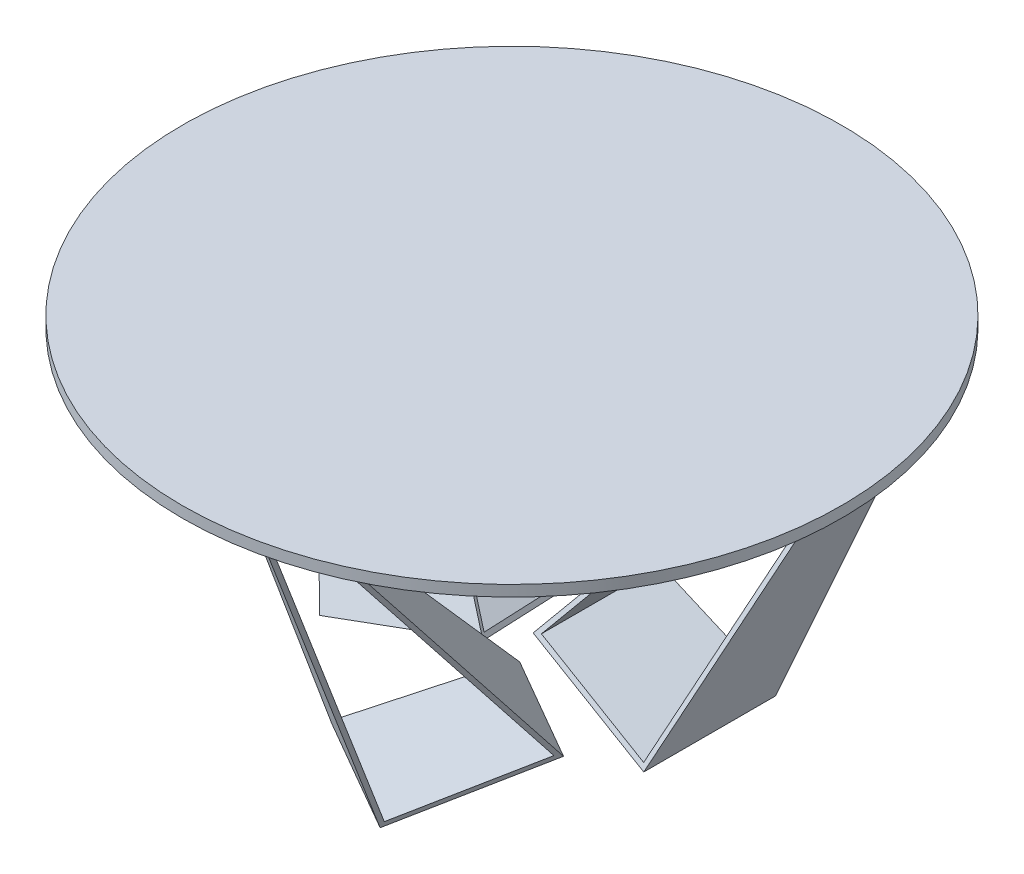
ISO-10303-21;
HEADER;
FILE_DESCRIPTION(('STEP AP214'),'2;1');
FILE_NAME('part.step','',(''),(''),'','','');
FILE_SCHEMA(('AUTOMOTIVE_DESIGN { 1 0 10303 214 1 1 1 1 }'));
ENDSEC;
DATA;
#1=APPLICATION_CONTEXT('core data for automotive mechanical design processes');
#2=APPLICATION_PROTOCOL_DEFINITION('international standard','automotive_design',2000,#1);
#3=PRODUCT_CONTEXT('',#1,'mechanical');
#4=PRODUCT('Part','Part','',(#3));
#5=PRODUCT_RELATED_PRODUCT_CATEGORY('part','',(#4));
#6=PRODUCT_DEFINITION_FORMATION('','',#4);
#7=PRODUCT_DEFINITION_CONTEXT('part definition',#1,'design');
#8=PRODUCT_DEFINITION('design','',#6,#7);
#9=PRODUCT_DEFINITION_SHAPE('','',#8);
#10=(LENGTH_UNIT() NAMED_UNIT(*) SI_UNIT(.MILLI.,.METRE.));
#11=(NAMED_UNIT(*) PLANE_ANGLE_UNIT() SI_UNIT($,.RADIAN.));
#12=(NAMED_UNIT(*) SI_UNIT($,.STERADIAN.) SOLID_ANGLE_UNIT());
#13=UNCERTAINTY_MEASURE_WITH_UNIT(LENGTH_MEASURE(1.E-05),#10,'distance_accuracy_value','');
#14=(GEOMETRIC_REPRESENTATION_CONTEXT(3) GLOBAL_UNCERTAINTY_ASSIGNED_CONTEXT((#13)) GLOBAL_UNIT_ASSIGNED_CONTEXT((#10,
#11,#12)) REPRESENTATION_CONTEXT('',''));
#15=CARTESIAN_POINT('',(0.,0.,0.));
#16=DIRECTION('',(0.,0.,1.));
#17=DIRECTION('',(1.,0.,0.));
#18=AXIS2_PLACEMENT_3D('',#15,#16,#17);
#19=CARTESIAN_POINT('',(0.,750.,0.));
#20=DIRECTION('',(0.,-1.,0.));
#21=DIRECTION('',(0.,0.,-1.));
#22=AXIS2_PLACEMENT_3D('',#19,#20,#21);
#23=CYLINDRICAL_SURFACE('',#22,750.);
#24=CARTESIAN_POINT('',(0.,750.,0.));
#25=DIRECTION('',(0.,1.,0.));
#26=DIRECTION('',(0.,0.,1.));
#27=AXIS2_PLACEMENT_3D('',#24,#25,#26);
#28=CIRCLE('',#27,750.);
#29=CARTESIAN_POINT('',(0.,750.,750.));
#30=VERTEX_POINT('',#29);
#31=EDGE_CURVE('E12',#30,#30,#28,.T.);
#32=ORIENTED_EDGE('',*,*,#31,.F.);
#33=EDGE_LOOP('',(#32));
#34=FACE_BOUND('',#33,.T.);
#35=CARTESIAN_POINT('',(0.,725.,0.));
#36=DIRECTION('',(0.,1.,0.));
#37=DIRECTION('',(0.,0.,1.));
#38=AXIS2_PLACEMENT_3D('',#35,#36,#37);
#39=CIRCLE('',#38,750.);
#40=CARTESIAN_POINT('',(0.,725.,750.));
#41=VERTEX_POINT('',#40);
#42=EDGE_CURVE('E49',#41,#41,#39,.T.);
#43=ORIENTED_EDGE('',*,*,#42,.T.);
#44=EDGE_LOOP('',(#43));
#45=FACE_BOUND('',#44,.T.);
#46=ADVANCED_FACE('F46',(#34,#45),#23,.T.);
#47=CARTESIAN_POINT('',(0.,750.,0.));
#48=DIRECTION('',(0.,1.,0.));
#49=DIRECTION('',(0.,0.,1.));
#50=AXIS2_PLACEMENT_3D('',#47,#48,#49);
#51=PLANE('',#50);
#52=ORIENTED_EDGE('',*,*,#31,.T.);
#53=EDGE_LOOP('',(#52));
#54=FACE_BOUND('',#53,.T.);
#55=ADVANCED_FACE('F61',(#54),#51,.T.);
#56=CARTESIAN_POINT('',(0.,725.,0.));
#57=DIRECTION('',(0.,1.,0.));
#58=DIRECTION('',(0.,0.,1.));
#59=AXIS2_PLACEMENT_3D('',#56,#57,#58);
#60=PLANE('',#59);
#61=ORIENTED_EDGE('',*,*,#42,.F.);
#62=EDGE_LOOP('',(#61));
#63=FACE_BOUND('',#62,.T.);
#64=ADVANCED_FACE('F59',(#63),#60,.F.);
#65=CLOSED_SHELL('',(#46,#55,#64));
#66=MANIFOLD_SOLID_BREP('B2',#65);
#67=CARTESIAN_POINT('',(-324.999999999995,0.,-562.916512459888));
#68=DIRECTION('',(-0.779900594511375,-0.434749065831176,0.450275818182282));
#69=DIRECTION('',(-0.376503735281354,0.900551636364579,0.217374532915584));
#70=AXIS2_PLACEMENT_3D('',#67,#68,#69);
#71=PLANE('',#70);
#72=DIRECTION('',(0.591437353248365,-0.747316742815364,0.302852345360579));
#73=VECTOR('',#72,1.);
#74=CARTESIAN_POINT('',(-568.448472121978,765.441822744605,-245.534358067453));
#75=LINE('',#74,#73);
#76=CARTESIAN_POINT('',(-536.442224657884,725.,-229.145188432743));
#77=VERTEX_POINT('',#76);
#78=CARTESIAN_POINT('',(-41.808122941318,100.,24.1379310344824));
#79=VERTEX_POINT('',#78);
#80=EDGE_CURVE('E203',#77,#79,#75,.T.);
#81=ORIENTED_EDGE('',*,*,#80,.T.);
#82=DIRECTION('',(-0.338214312932329,-0.312606012694366,-0.887630868861061));
#83=VECTOR('',#82,1.);
#84=CARTESIAN_POINT('',(-18.7516620389687,121.310713455729,84.648754027678));
#85=LINE('',#84,#83);
#86=CARTESIAN_POINT('',(-149.999999999998,0.,-259.807621135333));
#87=VERTEX_POINT('',#86);
#88=EDGE_CURVE('E201',#79,#87,#85,.T.);
#89=ORIENTED_EDGE('',*,*,#88,.T.);
#90=DIRECTION('',(-0.504361646553344,0.86252836467577,-0.040793989946337));
#91=VECTOR('',#90,1.);
#92=CARTESIAN_POINT('',(-255.006330463716,179.575388244545,-268.300787137371));
#93=LINE('',#92,#91);
#94=CARTESIAN_POINT('',(-573.942224657884,725.,-294.097093716576));
#95=VERTEX_POINT('',#94);
#96=EDGE_CURVE('E199',#87,#95,#93,.T.);
#97=ORIENTED_EDGE('',*,*,#96,.T.);
#98=DIRECTION('',(0.499999999999992,0.,0.866025403784443));
#99=VECTOR('',#98,1.);
#100=CARTESIAN_POINT('',(-628.10889132455,725.,-387.916512459891));
#101=LINE('',#100,#99);
#102=EDGE_CURVE('E189',#95,#77,#101,.T.);
#103=ORIENTED_EDGE('',*,*,#102,.T.);
#104=EDGE_LOOP('',(#81,#89,#97,#103));
#105=FACE_BOUND('',#104,.T.);
#106=DIRECTION('',(0.591437353248365,-0.747316742815364,0.302852345360579));
#107=VECTOR('',#106,1.);
#108=CARTESIAN_POINT('',(-570.569827691035,760.237649268637,-254.233372912157));
#109=LINE('',#108,#107);
#110=CARTESIAN_POINT('',(-534.768093275417,715.,-235.900680233557));
#111=VERTEX_POINT('',#110);
#112=CARTESIAN_POINT('',(-52.0916913571106,105.109274407034,11.259360586148));
#113=VERTEX_POINT('',#112);
#114=EDGE_CURVE('E168',#111,#113,#109,.T.);
#115=ORIENTED_EDGE('',*,*,#114,.F.);
#116=DIRECTION('',(0.499999999999993,0.,0.866025403784443));
#117=VECTOR('',#116,1.);
#118=CARTESIAN_POINT('',(-569.761412363752,715.,-296.510886820024));
#119=LINE('',#118,#117);
#120=CARTESIAN_POINT('',(-562.824282930138,715.,-284.495426182323));
#121=VERTEX_POINT('',#120);
#122=EDGE_CURVE('E187',#121,#111,#119,.T.);
#123=ORIENTED_EDGE('',*,*,#122,.F.);
#124=DIRECTION('',(-0.504361646553344,0.86252836467577,-0.040793989946337));
#125=VECTOR('',#124,1.);
#126=CARTESIAN_POINT('',(-251.264394048682,182.189380295067,-259.29570875423));
#127=LINE('',#126,#125);
#128=CARTESIAN_POINT('',(-152.126078067465,12.6491106406735,-251.27716195736));
#129=VERTEX_POINT('',#128);
#130=EDGE_CURVE('E186',#129,#121,#127,.T.);
#131=ORIENTED_EDGE('',*,*,#130,.F.);
#132=DIRECTION('',(-0.338214312932329,-0.312606012694366,-0.887630868861061));
#133=VECTOR('',#132,1.);
#134=CARTESIAN_POINT('',(-24.5328279023241,130.581485633982,83.5865714043666));
#135=LINE('',#134,#133);
#136=EDGE_CURVE('E190',#113,#129,#135,.T.);
#137=ORIENTED_EDGE('',*,*,#136,.F.);
#138=EDGE_LOOP('',(#115,#123,#131,#137));
#139=FACE_BOUND('',#138,.T.);
#140=ADVANCED_FACE('F96',(#105,#139),#71,.F.);
#141=CARTESIAN_POINT('',(-714.711431702994,725.,-337.916512459892));
#142=DIRECTION('',(0.848064400213762,0.202605604035952,-0.489630209753543));
#143=DIRECTION('',(0.175461600044227,-0.979260419507103,-0.101302802017974));
#144=AXIS2_PLACEMENT_3D('',#141,#142,#143);
#145=PLANE('',#144);
#146=DIRECTION('',(-0.436754996457905,0.790491038226829,-0.429382104368738));
#147=VECTOR('',#146,1.);
#148=CARTESIAN_POINT('',(-626.616326180475,731.464235326037,-182.656457799762));
#149=LINE('',#148,#147);
#150=CARTESIAN_POINT('',(-277.725388110183,100.,160.344827586204));
#151=VERTEX_POINT('',#150);
#152=CARTESIAN_POINT('',(-623.044765036329,725.,-179.145188432744));
#153=VERTEX_POINT('',#152);
#154=EDGE_CURVE('E207',#151,#153,#149,.T.);
#155=ORIENTED_EDGE('',*,*,#154,.T.);
#156=DIRECTION('',(0.499999999999992,0.,0.866025403784443));
#157=VECTOR('',#156,1.);
#158=CARTESIAN_POINT('',(-714.711431702994,725.,-337.916512459892));
#159=LINE('',#158,#157);
#160=CARTESIAN_POINT('',(-660.544765036328,725.,-244.097093716577));
#161=VERTEX_POINT('',#160);
#162=EDGE_CURVE('E196',#161,#153,#159,.T.);
#163=ORIENTED_EDGE('',*,*,#162,.F.);
#164=DIRECTION('',(0.321953630559994,-0.930920638739344,0.172431505643171));
#165=VECTOR('',#164,1.);
#166=CARTESIAN_POINT('',(-422.209549938311,35.8598580261049,-116.449829992113));
#167=LINE('',#166,#165);
#168=CARTESIAN_POINT('',(-409.807621135331,0.,-109.807621135335));
#169=VERTEX_POINT('',#168);
#170=EDGE_CURVE('E44',#161,#169,#167,.T.);
#171=ORIENTED_EDGE('',*,*,#170,.T.);
#172=DIRECTION('',(0.416789588830364,0.315553106034339,0.852474442968642));
#173=VECTOR('',#172,1.);
#174=CARTESIAN_POINT('',(-272.846195983278,103.694056358039,170.324411294601));
#175=LINE('',#174,#173);
#176=EDGE_CURVE('E205',#169,#151,#175,.T.);
#177=ORIENTED_EDGE('',*,*,#176,.T.);
#178=EDGE_LOOP('',(#155,#163,#171,#177));
#179=FACE_BOUND('',#178,.T.);
#180=DIRECTION('',(-0.436754996457905,0.790491038226829,-0.429382104368738));
#181=VECTOR('',#180,1.);
#182=CARTESIAN_POINT('',(-629.63914699577,725.641376755334,-190.301595752942));
#183=LINE('',#182,#181);
#184=CARTESIAN_POINT('',(-286.788332682832,105.109274407034,146.761529633451));
#185=VERTEX_POINT('',#184);
#186=CARTESIAN_POINT('',(-623.759669250508,715.,-184.521369888731));
#187=VERTEX_POINT('',#186);
#188=EDGE_CURVE('E167',#185,#187,#183,.T.);
#189=ORIENTED_EDGE('',*,*,#188,.F.);
#190=DIRECTION('',(0.416789588830364,0.315553106034339,0.852474442968642));
#191=VECTOR('',#190,1.);
#192=CARTESIAN_POINT('',(-276.180572764088,113.140452920441,168.457955048619));
#193=LINE('',#192,#191);
#194=CARTESIAN_POINT('',(-408.911781644149,12.6491106406735,-103.021866873317));
#195=VERTEX_POINT('',#194);
#196=EDGE_CURVE('E159',#195,#185,#193,.T.);
#197=ORIENTED_EDGE('',*,*,#196,.F.);
#198=DIRECTION('',(0.321953630559994,-0.930920638739344,0.172431505643171));
#199=VECTOR('',#198,1.);
#200=CARTESIAN_POINT('',(-417.992172291274,38.904826553929,-107.885130655709));
#201=LINE('',#200,#199);
#202=CARTESIAN_POINT('',(-651.815858905229,715.,-233.116115837497));
#203=VERTEX_POINT('',#202);
#204=EDGE_CURVE('E175',#203,#195,#201,.T.);
#205=ORIENTED_EDGE('',*,*,#204,.F.);
#206=DIRECTION('',(0.499999999999992,0.,0.866025403784443));
#207=VECTOR('',#206,1.);
#208=CARTESIAN_POINT('',(-712.919655005509,715.,-338.950995218512));
#209=LINE('',#208,#207);
#210=EDGE_CURVE('E180',#203,#187,#209,.T.);
#211=ORIENTED_EDGE('',*,*,#210,.T.);
#212=EDGE_LOOP('',(#189,#197,#205,#211));
#213=FACE_BOUND('',#212,.T.);
#214=ADVANCED_FACE('F179',(#179,#213),#145,.F.);
#215=CARTESIAN_POINT('',(-433.012701892222,100.,249.999999999996));
#216=DIRECTION('',(0.158113883008416,-0.948683298050514,0.273861278752585));
#217=DIRECTION('',(-0.474341649025249,-0.316227766016838,-0.821583836257754));
#218=AXIS2_PLACEMENT_3D('',#215,#216,#217);
#219=PLANE('',#218);
#220=ORIENTED_EDGE('',*,*,#176,.F.);
#221=DIRECTION('',(0.866025403784443,0.,-0.499999999999992));
#222=VECTOR('',#221,1.);
#223=CARTESIAN_POINT('',(-583.012701892219,0.,-9.80762113533698));
#224=LINE('',#223,#222);
#225=EDGE_CURVE('E209',#169,#87,#224,.T.);
#226=ORIENTED_EDGE('',*,*,#225,.T.);
#227=ORIENTED_EDGE('',*,*,#88,.F.);
#228=DIRECTION('',(0.866025403784443,0.,-0.499999999999992));
#229=VECTOR('',#228,1.);
#230=CARTESIAN_POINT('',(-433.012701892222,100.,249.999999999996));
#231=LINE('',#230,#229);
#232=EDGE_CURVE('E104',#151,#79,#231,.T.);
#233=ORIENTED_EDGE('',*,*,#232,.F.);
#234=EDGE_LOOP('',(#220,#226,#227,#233));
#235=FACE_BOUND('',#234,.T.);
#236=ADVANCED_FACE('F98',(#235),#219,.T.);
#237=CARTESIAN_POINT('',(-666.346035225551,725.,-154.145188432744));
#238=DIRECTION('',(0.400640111038844,0.598289232484683,0.693929027869329));
#239=DIRECTION('',(0.299144616242337,-0.801280222077701,0.518133674142432));
#240=AXIS2_PLACEMENT_3D('',#237,#238,#239);
#241=PLANE('',#240);
#242=ORIENTED_EDGE('',*,*,#154,.F.);
#243=ORIENTED_EDGE('',*,*,#232,.T.);
#244=ORIENTED_EDGE('',*,*,#80,.F.);
#245=DIRECTION('',(0.866025403784443,0.,-0.499999999999992));
#246=VECTOR('',#245,1.);
#247=CARTESIAN_POINT('',(-666.346035225551,725.,-154.145188432744));
#248=LINE('',#247,#246);
#249=EDGE_CURVE('E212',#153,#77,#248,.T.);
#250=ORIENTED_EDGE('',*,*,#249,.F.);
#251=EDGE_LOOP('',(#242,#243,#244,#250));
#252=FACE_BOUND('',#251,.T.);
#253=ADVANCED_FACE('F237',(#252),#241,.T.);
#254=CARTESIAN_POINT('',(-703.84603522555,725.,-219.097093716577));
#255=DIRECTION('',(0.,1.,0.));
#256=DIRECTION('',(0.499999999999992,0.,0.866025403784443));
#257=AXIS2_PLACEMENT_3D('',#254,#255,#256);
#258=PLANE('',#257);
#259=ORIENTED_EDGE('',*,*,#162,.T.);
#260=ORIENTED_EDGE('',*,*,#249,.T.);
#261=ORIENTED_EDGE('',*,*,#102,.F.);
#262=DIRECTION('',(0.866025403784443,0.,-0.499999999999992));
#263=VECTOR('',#262,1.);
#264=CARTESIAN_POINT('',(-703.84603522555,725.,-219.097093716577));
#265=LINE('',#264,#263);
#266=EDGE_CURVE('E215',#161,#95,#265,.T.);
#267=ORIENTED_EDGE('',*,*,#266,.F.);
#268=EDGE_LOOP('',(#259,#260,#261,#267));
#269=FACE_BOUND('',#268,.T.);
#270=ADVANCED_FACE('F233',(#269),#258,.T.);
#271=CARTESIAN_POINT('',(-583.012701892219,0.,-9.80762113533698));
#272=DIRECTION('',(-0.474341649025249,-0.316227766016838,-0.821583836257754));
#273=DIRECTION('',(-0.158113883008416,0.948683298050514,-0.273861278752584));
#274=AXIS2_PLACEMENT_3D('',#271,#272,#273);
#275=PLANE('',#274);
#276=ORIENTED_EDGE('',*,*,#170,.F.);
#277=ORIENTED_EDGE('',*,*,#266,.T.);
#278=ORIENTED_EDGE('',*,*,#96,.F.);
#279=ORIENTED_EDGE('',*,*,#225,.F.);
#280=EDGE_LOOP('',(#276,#277,#278,#279));
#281=FACE_BOUND('',#280,.T.);
#282=ADVANCED_FACE('F226',(#281),#275,.T.);
#283=CARTESIAN_POINT('',(-434.593840722306,109.486832980505,247.26138721247));
#284=DIRECTION('',(0.158113883008416,-0.948683298050514,0.273861278752585));
#285=DIRECTION('',(-0.474341649025249,-0.316227766016838,-0.821583836257754));
#286=AXIS2_PLACEMENT_3D('',#283,#284,#285);
#287=PLANE('',#286);
#288=ORIENTED_EDGE('',*,*,#196,.T.);
#289=DIRECTION('',(0.866025403784443,0.,-0.499999999999992));
#290=VECTOR('',#289,1.);
#291=CARTESIAN_POINT('',(-441.160178582512,105.109274407034,235.888156418929));
#292=LINE('',#291,#290);
#293=EDGE_CURVE('E162',#185,#113,#292,.T.);
#294=ORIENTED_EDGE('',*,*,#293,.T.);
#295=ORIENTED_EDGE('',*,*,#136,.T.);
#296=DIRECTION('',(0.866025403784443,0.,-0.499999999999992));
#297=VECTOR('',#296,1.);
#298=CARTESIAN_POINT('',(-579.850424232051,12.6491106406735,-4.33039556028533));
#299=LINE('',#298,#297);
#300=EDGE_CURVE('E119',#195,#129,#299,.T.);
#301=ORIENTED_EDGE('',*,*,#300,.F.);
#302=EDGE_LOOP('',(#288,#294,#295,#301));
#303=FACE_BOUND('',#302,.T.);
#304=ADVANCED_FACE('F161',(#303),#287,.F.);
#305=CARTESIAN_POINT('',(-670.352436335939,719.017107675153,-161.084478711437));
#306=DIRECTION('',(0.400640111038844,0.598289232484683,0.693929027869329));
#307=DIRECTION('',(0.299144616242337,-0.801280222077701,0.518133674142432));
#308=AXIS2_PLACEMENT_3D('',#305,#306,#307);
#309=PLANE('',#308);
#310=ORIENTED_EDGE('',*,*,#188,.T.);
#311=DIRECTION('',(0.866025403784443,0.,-0.499999999999992));
#312=VECTOR('',#311,1.);
#313=CARTESIAN_POINT('',(-668.852716137216,715.,-158.48688713011));
#314=LINE('',#313,#312);
#315=EDGE_CURVE('E176',#187,#111,#314,.T.);
#316=ORIENTED_EDGE('',*,*,#315,.T.);
#317=ORIENTED_EDGE('',*,*,#114,.T.);
#318=ORIENTED_EDGE('',*,*,#293,.F.);
#319=EDGE_LOOP('',(#310,#316,#317,#318));
#320=FACE_BOUND('',#319,.T.);
#321=ADVANCED_FACE('F171',(#320),#309,.F.);
#322=CARTESIAN_POINT('',(-703.84603522555,715.,-219.097093716577));
#323=DIRECTION('',(0.,1.,0.));
#324=DIRECTION('',(0.499999999999992,0.,0.866025403784443));
#325=AXIS2_PLACEMENT_3D('',#322,#323,#324);
#326=PLANE('',#325);
#327=ORIENTED_EDGE('',*,*,#210,.F.);
#328=DIRECTION('',(0.866025403784443,0.,-0.499999999999992));
#329=VECTOR('',#328,1.);
#330=CARTESIAN_POINT('',(-696.908905791937,715.,-207.081633078876));
#331=LINE('',#330,#329);
#332=EDGE_CURVE('E111',#203,#121,#331,.T.);
#333=ORIENTED_EDGE('',*,*,#332,.T.);
#334=ORIENTED_EDGE('',*,*,#122,.T.);
#335=ORIENTED_EDGE('',*,*,#315,.F.);
#336=EDGE_LOOP('',(#327,#333,#334,#335));
#337=FACE_BOUND('',#336,.T.);
#338=ADVANCED_FACE('F259',(#337),#326,.F.);
#339=CARTESIAN_POINT('',(-578.269285401967,3.16227766016838,-1.59178277275948));
#340=DIRECTION('',(-0.474341649025249,-0.316227766016838,-0.821583836257754));
#341=DIRECTION('',(-0.158113883008416,0.948683298050514,-0.273861278752584));
#342=AXIS2_PLACEMENT_3D('',#339,#340,#341);
#343=PLANE('',#342);
#344=ORIENTED_EDGE('',*,*,#204,.T.);
#345=ORIENTED_EDGE('',*,*,#300,.T.);
#346=ORIENTED_EDGE('',*,*,#130,.T.);
#347=ORIENTED_EDGE('',*,*,#332,.F.);
#348=EDGE_LOOP('',(#344,#345,#346,#347));
#349=FACE_BOUND('',#348,.T.);
#350=ADVANCED_FACE('F263',(#349),#343,.F.);
#351=CLOSED_SHELL('',(#140,#214,#236,#253,#270,#282,#304,#321,#338,#350));
#352=MANIFOLD_SOLID_BREP('B7',#351);
#353=CARTESIAN_POINT('',(-325.000000000003,0.,562.916512459884));
#354=DIRECTION('',(0.779900594511369,-0.434749065831176,0.450275818182293));
#355=DIRECTION('',(0.376503735281351,0.900551636364579,0.21737453291559));
#356=AXIS2_PLACEMENT_3D('',#353,#354,#355);
#357=PLANE('',#356);
#358=DIRECTION('',(-0.0334408519462263,-0.747316742815364,-0.663625945340404));
#359=VECTOR('',#358,1.);
#360=CARTESIAN_POINT('',(71.5852444726724,765.441822744605,615.05799663381));
#361=LINE('',#360,#359);
#362=CARTESIAN_POINT('',(69.7755579912175,725.,579.145188432738));
#363=VERTEX_POINT('',#362);
#364=CARTESIAN_POINT('',(41.8081229413177,100.,24.137931034483));
#365=VERTEX_POINT('',#364);
#366=EDGE_CURVE('E461',#363,#365,#361,.T.);
#367=ORIENTED_EDGE('',*,*,#366,.T.);
#368=DIRECTION('',(-0.599603725150765,-0.312606012694366,0.73671762135343));
#369=VECTOR('',#368,1.);
#370=CARTESIAN_POINT('',(82.6838024061537,121.310713455729,-26.0849613249122));
#371=LINE('',#370,#369);
#372=CARTESIAN_POINT('',(-150.000000000001,0.,259.807621135331));
#373=VERTEX_POINT('',#372);
#374=EDGE_CURVE('E459',#365,#373,#371,.T.);
#375=ORIENTED_EDGE('',*,*,#374,.T.);
#376=DIRECTION('',(0.216852191661419,0.86252836467577,0.457186993582912));
#377=VECTOR('',#376,1.);
#378=CARTESIAN_POINT('',(-104.852132284465,179.575388244545,354.992353876114));
#379=LINE('',#378,#377);
#380=CARTESIAN_POINT('',(32.2755579912172,725.,644.097093716571));
#381=VERTEX_POINT('',#380);
#382=EDGE_CURVE('E457',#373,#381,#379,.T.);
#383=ORIENTED_EDGE('',*,*,#382,.T.);
#384=DIRECTION('',(0.500000000000004,0.,-0.866025403784436));
#385=VECTOR('',#384,1.);
#386=CARTESIAN_POINT('',(-21.89110867545,725.,737.916512459885));
#387=LINE('',#386,#385);
#388=EDGE_CURVE('E447',#381,#363,#387,.T.);
#389=ORIENTED_EDGE('',*,*,#388,.T.);
#390=EDGE_LOOP('',(#367,#375,#383,#389));
#391=FACE_BOUND('',#390,.T.);
#392=DIRECTION('',(-0.0334408519462263,-0.747316742815364,-0.663625945340404));
#393=VECTOR('',#392,1.);
#394=CARTESIAN_POINT('',(65.1123544137904,760.237649268637,621.244651869425));
#395=LINE('',#394,#393);
#396=CARTESIAN_POINT('',(63.0880647854211,715.,581.073094026656));
#397=VERTEX_POINT('',#396);
#398=CARTESIAN_POINT('',(35.796737976529,105.109274407034,39.4830477482819));
#399=VERTEX_POINT('',#398);
#400=EDGE_CURVE('E426',#397,#399,#395,.T.);
#401=ORIENTED_EDGE('',*,*,#400,.F.);
#402=DIRECTION('',(0.500000000000003,0.,-0.866025403784437));
#403=VECTOR('',#402,1.);
#404=CARTESIAN_POINT('',(28.0947456970854,715.,641.683300613123));
#405=LINE('',#404,#403);
#406=CARTESIAN_POINT('',(35.0318751306995,715.,629.667839975422));
#407=VERTEX_POINT('',#406);
#408=EDGE_CURVE('E445',#407,#397,#405,.T.);
#409=ORIENTED_EDGE('',*,*,#408,.F.);
#410=DIRECTION('',(0.216852191661419,0.86252836467577,0.457186993582912));
#411=VECTOR('',#410,1.);
#412=CARTESIAN_POINT('',(-98.9244738491122,182.189380295067,347.249202689777));
#413=LINE('',#412,#411);
#414=CARTESIAN_POINT('',(-141.549366612197,12.6491106406735,257.383629163201));
#415=VERTEX_POINT('',#414);
#416=EDGE_CURVE('E444',#415,#407,#413,.T.);
#417=ORIENTED_EDGE('',*,*,#416,.F.);
#418=DIRECTION('',(-0.599603725150765,-0.312606012694366,0.73671762135343));
#419=VECTOR('',#418,1.);
#420=CARTESIAN_POINT('',(84.6545082025854,130.581485633982,-20.5472335120993));
#421=LINE('',#420,#419);
#422=EDGE_CURVE('E448',#399,#415,#421,.T.);
#423=ORIENTED_EDGE('',*,*,#422,.F.);
#424=EDGE_LOOP('',(#401,#409,#417,#423));
#425=FACE_BOUND('',#424,.T.);
#426=ADVANCED_FACE('F354',(#391,#425),#357,.F.);
#427=CARTESIAN_POINT('',(64.7114317029936,725.,787.916512459885));
#428=DIRECTION('',(-0.848064400213755,0.202605604035952,-0.489630209753555));
#429=DIRECTION('',(-0.175461600044225,-0.979260419507103,-0.101302802017977));
#430=AXIS2_PLACEMENT_3D('',#427,#428,#429);
#431=PLANE('',#430);
#432=DIRECTION('',(-0.153478312084793,0.790491038226829,0.592931974346698));
#433=VECTOR('',#432,1.);
#434=CARTESIAN_POINT('',(155.123030470366,731.464235326037,633.993885798248));
#435=LINE('',#434,#433);
#436=CARTESIAN_POINT('',(277.725388110181,100.,160.344827586208));
#437=VERTEX_POINT('',#436);
#438=CARTESIAN_POINT('',(156.378098369661,725.,629.145188432739));
#439=VERTEX_POINT('',#438);
#440=EDGE_CURVE('E465',#437,#439,#435,.T.);
#441=ORIENTED_EDGE('',*,*,#440,.T.);
#442=DIRECTION('',(0.500000000000004,0.,-0.866025403784436));
#443=VECTOR('',#442,1.);
#444=CARTESIAN_POINT('',(64.7114317029936,725.,787.916512459885));
#445=LINE('',#444,#443);
#446=CARTESIAN_POINT('',(118.878098369661,725.,694.097093716572));
#447=VERTEX_POINT('',#446);
#448=EDGE_CURVE('E454',#447,#439,#445,.T.);
#449=ORIENTED_EDGE('',*,*,#448,.F.);
#450=DIRECTION('',(-0.0116467509802127,-0.930920638739344,-0.36503577572717));
#451=VECTOR('',#450,1.);
#452=CARTESIAN_POINT('',(110.256263929609,35.8598580261049,423.869110963028));
#453=LINE('',#452,#451);
#454=CARTESIAN_POINT('',(109.80762113533,0.,409.807621135332));
#455=VERTEX_POINT('',#454);
#456=EDGE_CURVE('E94',#447,#455,#453,.T.);
#457=ORIENTED_EDGE('',*,*,#456,.T.);
#458=DIRECTION('',(0.529869729272647,0.315553106034339,-0.78718759344429));
#459=VECTOR('',#458,1.);
#460=CARTESIAN_POINT('',(283.928365057393,103.694056358039,151.129531400164));
#461=LINE('',#460,#459);
#462=EDGE_CURVE('E463',#455,#437,#461,.T.);
#463=ORIENTED_EDGE('',*,*,#462,.T.);
#464=EDGE_LOOP('',(#441,#449,#457,#463));
#465=FACE_BOUND('',#464,.T.);
#466=DIRECTION('',(-0.153478312084793,0.790491038226829,0.592931974346698));
#467=VECTOR('',#466,1.);
#468=CARTESIAN_POINT('',(150.013557195123,725.641376755334,640.434294391972));
#469=LINE('',#468,#467);
#470=CARTESIAN_POINT('',(270.493379302249,105.109274407034,174.985216795589));
#471=VERTEX_POINT('',#470);
#472=CARTESIAN_POINT('',(152.079640760511,715.,632.452404371484));
#473=VERTEX_POINT('',#472);
#474=EDGE_CURVE('E425',#471,#473,#469,.T.);
#475=ORIENTED_EDGE('',*,*,#474,.F.);
#476=DIRECTION('',(0.529869729272647,0.315553106034339,-0.78718759344429));
#477=VECTOR('',#476,1.);
#478=CARTESIAN_POINT('',(283.979154923726,113.140452920441,154.950414521126));
#479=LINE('',#478,#477);
#480=CARTESIAN_POINT('',(115.236336964485,12.6491106406735,405.638924247247));
#481=VERTEX_POINT('',#480);
#482=EDGE_CURVE('E417',#481,#471,#479,.T.);
#483=ORIENTED_EDGE('',*,*,#482,.F.);
#484=DIRECTION('',(-0.0116467509802127,-0.930920638739344,-0.36503577572717));
#485=VECTOR('',#484,1.);
#486=CARTESIAN_POINT('',(115.564822307192,38.904826553929,415.93440511514));
#487=LINE('',#486,#485);
#488=CARTESIAN_POINT('',(124.02345110579,715.,681.04715032025));
#489=VERTEX_POINT('',#488);
#490=EDGE_CURVE('E433',#489,#481,#487,.T.);
#491=ORIENTED_EDGE('',*,*,#490,.F.);
#492=DIRECTION('',(0.500000000000004,0.,-0.866025403784437));
#493=VECTOR('',#492,1.);
#494=CARTESIAN_POINT('',(62.9196550055087,715.,786.882029701265));
#495=LINE('',#494,#493);
#496=EDGE_CURVE('E438',#489,#473,#495,.T.);
#497=ORIENTED_EDGE('',*,*,#496,.T.);
#498=EDGE_LOOP('',(#475,#483,#491,#497));
#499=FACE_BOUND('',#498,.T.);
#500=ADVANCED_FACE('F437',(#465,#499),#431,.F.);
#501=CARTESIAN_POINT('',(433.012701892218,100.,250.000000000002));
#502=DIRECTION('',(0.15811388300842,-0.948683298050514,-0.273861278752582));
#503=DIRECTION('',(-0.474341649025261,-0.316227766016838,0.821583836257747));
#504=AXIS2_PLACEMENT_3D('',#501,#502,#503);
#505=PLANE('',#504);
#506=ORIENTED_EDGE('',*,*,#462,.F.);
#507=DIRECTION('',(-0.866025403784436,0.,-0.500000000000004));
#508=VECTOR('',#507,1.);
#509=CARTESIAN_POINT('',(283.012701892217,0.,509.807621135333));
#510=LINE('',#509,#508);
#511=EDGE_CURVE('E467',#455,#373,#510,.T.);
#512=ORIENTED_EDGE('',*,*,#511,.T.);
#513=ORIENTED_EDGE('',*,*,#374,.F.);
#514=DIRECTION('',(-0.866025403784436,0.,-0.500000000000004));
#515=VECTOR('',#514,1.);
#516=CARTESIAN_POINT('',(433.012701892218,100.,250.000000000002));
#517=LINE('',#516,#515);
#518=EDGE_CURVE('E362',#437,#365,#517,.T.);
#519=ORIENTED_EDGE('',*,*,#518,.F.);
#520=EDGE_LOOP('',(#506,#512,#513,#519));
#521=FACE_BOUND('',#520,.T.);
#522=ADVANCED_FACE('F356',(#521),#505,.T.);
#523=CARTESIAN_POINT('',(199.679368558883,725.,654.145188432739));
#524=DIRECTION('',(0.400640111038854,0.598289232484683,-0.693929027869324));
#525=DIRECTION('',(0.299144616242344,-0.801280222077701,-0.518133674142428));
#526=AXIS2_PLACEMENT_3D('',#523,#524,#525);
#527=PLANE('',#526);
#528=ORIENTED_EDGE('',*,*,#440,.F.);
#529=ORIENTED_EDGE('',*,*,#518,.T.);
#530=ORIENTED_EDGE('',*,*,#366,.F.);
#531=DIRECTION('',(-0.866025403784436,0.,-0.500000000000004));
#532=VECTOR('',#531,1.);
#533=CARTESIAN_POINT('',(199.679368558883,725.,654.145188432739));
#534=LINE('',#533,#532);
#535=EDGE_CURVE('E470',#439,#363,#534,.T.);
#536=ORIENTED_EDGE('',*,*,#535,.F.);
#537=EDGE_LOOP('',(#528,#529,#530,#536));
#538=FACE_BOUND('',#537,.T.);
#539=ADVANCED_FACE('F495',(#538),#527,.T.);
#540=CARTESIAN_POINT('',(162.179368558883,725.,719.097093716572));
#541=DIRECTION('',(0.,1.,0.));
#542=DIRECTION('',(0.500000000000004,0.,-0.866025403784436));
#543=AXIS2_PLACEMENT_3D('',#540,#541,#542);
#544=PLANE('',#543);
#545=ORIENTED_EDGE('',*,*,#448,.T.);
#546=ORIENTED_EDGE('',*,*,#535,.T.);
#547=ORIENTED_EDGE('',*,*,#388,.F.);
#548=DIRECTION('',(-0.866025403784436,0.,-0.500000000000004));
#549=VECTOR('',#548,1.);
#550=CARTESIAN_POINT('',(162.179368558883,725.,719.097093716572));
#551=LINE('',#550,#549);
#552=EDGE_CURVE('E473',#447,#381,#551,.T.);
#553=ORIENTED_EDGE('',*,*,#552,.F.);
#554=EDGE_LOOP('',(#545,#546,#547,#553));
#555=FACE_BOUND('',#554,.T.);
#556=ADVANCED_FACE('F491',(#555),#544,.T.);
#557=CARTESIAN_POINT('',(283.012701892217,0.,509.807621135333));
#558=DIRECTION('',(-0.474341649025261,-0.316227766016838,0.821583836257747));
#559=DIRECTION('',(-0.15811388300842,0.948683298050514,0.273861278752582));
#560=AXIS2_PLACEMENT_3D('',#557,#558,#559);
#561=PLANE('',#560);
#562=ORIENTED_EDGE('',*,*,#456,.F.);
#563=ORIENTED_EDGE('',*,*,#552,.T.);
#564=ORIENTED_EDGE('',*,*,#382,.F.);
#565=ORIENTED_EDGE('',*,*,#511,.F.);
#566=EDGE_LOOP('',(#562,#563,#564,#565));
#567=FACE_BOUND('',#566,.T.);
#568=ADVANCED_FACE('F484',(#567),#561,.T.);
#569=CARTESIAN_POINT('',(431.431563062134,109.486832980505,252.738612787528));
#570=DIRECTION('',(0.15811388300842,-0.948683298050514,-0.273861278752582));
#571=DIRECTION('',(-0.474341649025261,-0.316227766016838,0.821583836257747));
#572=AXIS2_PLACEMENT_3D('',#569,#570,#571);
#573=PLANE('',#572);
#574=ORIENTED_EDGE('',*,*,#482,.T.);
#575=DIRECTION('',(-0.866025403784436,0.,-0.500000000000004));
#576=VECTOR('',#575,1.);
#577=CARTESIAN_POINT('',(424.865225201928,105.109274407034,264.111843581069));
#578=LINE('',#577,#576);
#579=EDGE_CURVE('E420',#471,#399,#578,.T.);
#580=ORIENTED_EDGE('',*,*,#579,.T.);
#581=ORIENTED_EDGE('',*,*,#422,.T.);
#582=DIRECTION('',(-0.866025403784436,0.,-0.500000000000004));
#583=VECTOR('',#582,1.);
#584=CARTESIAN_POINT('',(286.174979552385,12.6491106406735,504.330395560281));
#585=LINE('',#584,#583);
#586=EDGE_CURVE('E377',#481,#415,#585,.T.);
#587=ORIENTED_EDGE('',*,*,#586,.F.);
#588=EDGE_LOOP('',(#574,#580,#581,#587));
#589=FACE_BOUND('',#588,.T.);
#590=ADVANCED_FACE('F419',(#589),#573,.F.);
#591=CARTESIAN_POINT('',(195.672967448495,719.017107675153,661.084478711432));
#592=DIRECTION('',(0.400640111038854,0.598289232484683,-0.693929027869324));
#593=DIRECTION('',(0.299144616242344,-0.801280222077701,-0.518133674142428));
#594=AXIS2_PLACEMENT_3D('',#591,#592,#593);
#595=PLANE('',#594);
#596=ORIENTED_EDGE('',*,*,#474,.T.);
#597=DIRECTION('',(-0.866025403784436,0.,-0.500000000000004));
#598=VECTOR('',#597,1.);
#599=CARTESIAN_POINT('',(197.172687647218,715.,658.486887130105));
#600=LINE('',#599,#598);
#601=EDGE_CURVE('E434',#473,#397,#600,.T.);
#602=ORIENTED_EDGE('',*,*,#601,.T.);
#603=ORIENTED_EDGE('',*,*,#400,.T.);
#604=ORIENTED_EDGE('',*,*,#579,.F.);
#605=EDGE_LOOP('',(#596,#602,#603,#604));
#606=FACE_BOUND('',#605,.T.);
#607=ADVANCED_FACE('F429',(#606),#595,.F.);
#608=CARTESIAN_POINT('',(162.179368558883,715.,719.097093716572));
#609=DIRECTION('',(0.,1.,0.));
#610=DIRECTION('',(0.500000000000004,0.,-0.866025403784436));
#611=AXIS2_PLACEMENT_3D('',#608,#609,#610);
#612=PLANE('',#611);
#613=ORIENTED_EDGE('',*,*,#496,.F.);
#614=DIRECTION('',(-0.866025403784436,0.,-0.500000000000004));
#615=VECTOR('',#614,1.);
#616=CARTESIAN_POINT('',(169.116497992497,715.,707.081633078871));
#617=LINE('',#616,#615);
#618=EDGE_CURVE('E369',#489,#407,#617,.T.);
#619=ORIENTED_EDGE('',*,*,#618,.T.);
#620=ORIENTED_EDGE('',*,*,#408,.T.);
#621=ORIENTED_EDGE('',*,*,#601,.F.);
#622=EDGE_LOOP('',(#613,#619,#620,#621));
#623=FACE_BOUND('',#622,.T.);
#624=ADVANCED_FACE('F517',(#623),#612,.F.);
#625=CARTESIAN_POINT('',(287.75611838247,3.16227766016838,501.591782772755));
#626=DIRECTION('',(-0.474341649025261,-0.316227766016838,0.821583836257747));
#627=DIRECTION('',(-0.15811388300842,0.948683298050514,0.273861278752582));
#628=AXIS2_PLACEMENT_3D('',#625,#626,#627);
#629=PLANE('',#628);
#630=ORIENTED_EDGE('',*,*,#490,.T.);
#631=ORIENTED_EDGE('',*,*,#586,.T.);
#632=ORIENTED_EDGE('',*,*,#416,.T.);
#633=ORIENTED_EDGE('',*,*,#618,.F.);
#634=EDGE_LOOP('',(#630,#631,#632,#633));
#635=FACE_BOUND('',#634,.T.);
#636=ADVANCED_FACE('F521',(#635),#629,.F.);
#637=CLOSED_SHELL('',(#426,#500,#522,#539,#556,#568,#590,#607,#624,#636));
#638=MANIFOLD_SOLID_BREP('B38',#637);
#639=CARTESIAN_POINT('',(650.,0.,0.));
#640=DIRECTION('',(0.,-0.434749065831176,-0.900551636364578));
#641=DIRECTION('',(0.,0.900551636364579,-0.434749065831176));
#642=AXIS2_PLACEMENT_3D('',#639,#640,#641);
#643=PLANE('',#642);
#644=DIRECTION('',(-0.557996501302139,-0.747316742815364,0.360773599979831));
#645=VECTOR('',#644,1.);
#646=CARTESIAN_POINT('',(496.863227649305,765.441822744605,-369.523638566361));
#647=LINE('',#646,#645);
#648=CARTESIAN_POINT('',(466.666666666666,725.,-350.));
#649=VERTEX_POINT('',#648);
#650=CARTESIAN_POINT('',(0.,100.,-48.2758620689656));
#651=VERTEX_POINT('',#650);
#652=EDGE_CURVE('E710',#649,#651,#647,.T.);
#653=ORIENTED_EDGE('',*,*,#652,.T.);
#654=DIRECTION('',(0.937818038083099,-0.312606012694366,0.150913247507625));
#655=VECTOR('',#654,1.);
#656=CARTESIAN_POINT('',(-63.9321403671857,121.310713455729,-58.5637927027656));
#657=LINE('',#656,#655);
#658=CARTESIAN_POINT('',(300.,0.,0.));
#659=VERTEX_POINT('',#658);
#660=EDGE_CURVE('E708',#651,#659,#657,.T.);
#661=ORIENTED_EDGE('',*,*,#660,.T.);
#662=DIRECTION('',(0.287509454891923,0.86252836467577,-0.416393003636578));
#663=VECTOR('',#662,1.);
#664=CARTESIAN_POINT('',(359.858462748182,179.575388244545,-86.6915667387458));
#665=LINE('',#664,#663);
#666=CARTESIAN_POINT('',(541.666666666667,725.,-350.));
#667=VERTEX_POINT('',#666);
#668=EDGE_CURVE('E706',#659,#667,#665,.T.);
#669=ORIENTED_EDGE('',*,*,#668,.T.);
#670=DIRECTION('',(-1.,0.,0.));
#671=VECTOR('',#670,1.);
#672=CARTESIAN_POINT('',(650.,725.,-350.));
#673=LINE('',#672,#671);
#674=EDGE_CURVE('E696',#667,#649,#673,.T.);
#675=ORIENTED_EDGE('',*,*,#674,.T.);
#676=EDGE_LOOP('',(#653,#661,#669,#675));
#677=FACE_BOUND('',#676,.T.);
#678=DIRECTION('',(-0.557996501302139,-0.747316742815364,0.360773599979831));
#679=VECTOR('',#678,1.);
#680=CARTESIAN_POINT('',(505.457473277244,760.237649268637,-367.011278957273));
#681=LINE('',#680,#679);
#682=CARTESIAN_POINT('',(471.680028489996,715.,-345.172413793103));
#683=VERTEX_POINT('',#682);
#684=CARTESIAN_POINT('',(16.2949533805814,105.109274407034,-50.7424083344303));
#685=VERTEX_POINT('',#684);
#686=EDGE_CURVE('E675',#683,#685,#681,.T.);
#687=ORIENTED_EDGE('',*,*,#686,.F.);
#688=DIRECTION('',(-1.,0.,0.));
#689=VECTOR('',#688,1.);
#690=CARTESIAN_POINT('',(541.666666666667,715.,-345.172413793103));
#691=LINE('',#690,#689);
#692=CARTESIAN_POINT('',(527.792407799439,715.,-345.172413793103));
#693=VERTEX_POINT('',#692);
#694=EDGE_CURVE('E694',#693,#683,#691,.T.);
#695=ORIENTED_EDGE('',*,*,#694,.F.);
#696=DIRECTION('',(0.287509454891923,0.86252836467577,-0.416393003636578));
#697=VECTOR('',#696,1.);
#698=CARTESIAN_POINT('',(350.188867897795,182.189380295067,-87.9534939355498));
#699=LINE('',#698,#697);
#700=CARTESIAN_POINT('',(293.675444679663,12.6491106406735,-6.10646720584238));
#701=VERTEX_POINT('',#700);
#702=EDGE_CURVE('E693',#701,#693,#699,.T.);
#703=ORIENTED_EDGE('',*,*,#702,.F.);
#704=DIRECTION('',(0.937818038083099,-0.312606012694366,0.150913247507625));
#705=VECTOR('',#704,1.);
#706=CARTESIAN_POINT('',(-60.1216803002619,130.581485633982,-63.0393378922671));
#707=LINE('',#706,#705);
#708=EDGE_CURVE('E697',#685,#701,#707,.T.);
#709=ORIENTED_EDGE('',*,*,#708,.F.);
#710=EDGE_LOOP('',(#687,#695,#703,#709));
#711=FACE_BOUND('',#710,.T.);
#712=ADVANCED_FACE('F603',(#677,#711),#643,.F.);
#713=CARTESIAN_POINT('',(650.,725.,-450.));
#714=DIRECTION('',(0.,0.202605604035952,0.979260419507103));
#715=DIRECTION('',(0.,-0.979260419507103,0.202605604035952));
#716=AXIS2_PLACEMENT_3D('',#713,#714,#715);
#717=PLANE('',#716);
#718=DIRECTION('',(0.590233308542699,0.790491038226829,-0.163549869977965));
#719=VECTOR('',#718,1.);
#720=CARTESIAN_POINT('',(471.493295710108,731.464235326037,-451.33742799849));
#721=LINE('',#720,#719);
#722=CARTESIAN_POINT('',(0.,100.,-320.689655172414));
#723=VERTEX_POINT('',#722);
#724=CARTESIAN_POINT('',(466.666666666666,725.,-450.));
#725=VERTEX_POINT('',#724);
#726=EDGE_CURVE('E714',#723,#725,#721,.T.);
#727=ORIENTED_EDGE('',*,*,#726,.T.);
#728=DIRECTION('',(-1.,0.,0.));
#729=VECTOR('',#728,1.);
#730=CARTESIAN_POINT('',(650.,725.,-450.));
#731=LINE('',#730,#729);
#732=CARTESIAN_POINT('',(541.666666666667,725.,-450.));
#733=VERTEX_POINT('',#732);
#734=EDGE_CURVE('E703',#733,#725,#731,.T.);
#735=ORIENTED_EDGE('',*,*,#734,.F.);
#736=DIRECTION('',(-0.310306879579781,-0.930920638739344,0.192604270084002));
#737=VECTOR('',#736,1.);
#738=CARTESIAN_POINT('',(311.953286008702,35.8598580261049,-307.419280970918));
#739=LINE('',#738,#737);
#740=CARTESIAN_POINT('',(300.,0.,-300.));
#741=VERTEX_POINT('',#740);
#742=EDGE_CURVE('E352',#733,#741,#739,.T.);
#743=ORIENTED_EDGE('',*,*,#742,.T.);
#744=DIRECTION('',(-0.946659318103016,0.315553106034339,-0.0652868495243459));
#745=VECTOR('',#744,1.);
#746=CARTESIAN_POINT('',(-11.0821690741179,103.694056358039,-321.453942694767));
#747=LINE('',#746,#745);
#748=EDGE_CURVE('E712',#741,#723,#747,.T.);
#749=ORIENTED_EDGE('',*,*,#748,.T.);
#750=EDGE_LOOP('',(#727,#735,#743,#749));
#751=FACE_BOUND('',#750,.T.);
#752=DIRECTION('',(0.590233308542699,0.790491038226829,-0.163549869977965));
#753=VECTOR('',#752,1.);
#754=CARTESIAN_POINT('',(479.625589800645,725.641376755334,-450.132698639035));
#755=LINE('',#754,#753);
#756=CARTESIAN_POINT('',(16.2949533805814,105.109274407034,-321.746746429041));
#757=VERTEX_POINT('',#756);
#758=CARTESIAN_POINT('',(471.680028489996,715.,-447.931034482758));
#759=VERTEX_POINT('',#758);
#760=EDGE_CURVE('E674',#757,#759,#755,.T.);
#761=ORIENTED_EDGE('',*,*,#760,.F.);
#762=DIRECTION('',(-0.946659318103016,0.315553106034339,-0.0652868495243459));
#763=VECTOR('',#762,1.);
#764=CARTESIAN_POINT('',(-7.79858215964045,113.140452920441,-323.408369569747));
#765=LINE('',#764,#763);
#766=CARTESIAN_POINT('',(293.675444679663,12.6491106406735,-302.617057373932));
#767=VERTEX_POINT('',#766);
#768=EDGE_CURVE('E666',#767,#757,#765,.T.);
#769=ORIENTED_EDGE('',*,*,#768,.F.);
#770=DIRECTION('',(-0.310306879579781,-0.930920638739344,0.192604270084002));
#771=VECTOR('',#770,1.);
#772=CARTESIAN_POINT('',(302.427349984082,38.904826553929,-308.049274459434));
#773=LINE('',#772,#771);
#774=CARTESIAN_POINT('',(527.792407799439,715.,-447.931034482758));
#775=VERTEX_POINT('',#774);
#776=EDGE_CURVE('E682',#775,#767,#773,.T.);
#777=ORIENTED_EDGE('',*,*,#776,.F.);
#778=DIRECTION('',(-1.,0.,0.));
#779=VECTOR('',#778,1.);
#780=CARTESIAN_POINT('',(650.,715.,-447.931034482759));
#781=LINE('',#780,#779);
#782=EDGE_CURVE('E687',#775,#759,#781,.T.);
#783=ORIENTED_EDGE('',*,*,#782,.T.);
#784=EDGE_LOOP('',(#761,#769,#777,#783));
#785=FACE_BOUND('',#784,.T.);
#786=ADVANCED_FACE('F686',(#751,#785),#717,.F.);
#787=CARTESIAN_POINT('',(0.,100.,-500.));
#788=DIRECTION('',(-0.316227766016838,-0.948683298050514,0.));
#789=DIRECTION('',(0.948683298050514,-0.316227766016838,0.));
#790=AXIS2_PLACEMENT_3D('',#787,#788,#789);
#791=PLANE('',#790);
#792=ORIENTED_EDGE('',*,*,#748,.F.);
#793=DIRECTION('',(0.,0.,1.));
#794=VECTOR('',#793,1.);
#795=CARTESIAN_POINT('',(300.,0.,-500.));
#796=LINE('',#795,#794);
#797=EDGE_CURVE('E716',#741,#659,#796,.T.);
#798=ORIENTED_EDGE('',*,*,#797,.T.);
#799=ORIENTED_EDGE('',*,*,#660,.F.);
#800=DIRECTION('',(0.,0.,1.));
#801=VECTOR('',#800,1.);
#802=CARTESIAN_POINT('',(0.,100.,-500.));
#803=LINE('',#802,#801);
#804=EDGE_CURVE('E611',#723,#651,#803,.T.);
#805=ORIENTED_EDGE('',*,*,#804,.F.);
#806=EDGE_LOOP('',(#792,#798,#799,#805));
#807=FACE_BOUND('',#806,.T.);
#808=ADVANCED_FACE('F605',(#807),#791,.T.);
#809=CARTESIAN_POINT('',(466.666666666666,725.,-500.));
#810=DIRECTION('',(-0.801280222077701,0.598289232484683,0.));
#811=DIRECTION('',(-0.598289232484683,-0.801280222077701,0.));
#812=AXIS2_PLACEMENT_3D('',#809,#810,#811);
#813=PLANE('',#812);
#814=ORIENTED_EDGE('',*,*,#726,.F.);
#815=ORIENTED_EDGE('',*,*,#804,.T.);
#816=ORIENTED_EDGE('',*,*,#652,.F.);
#817=DIRECTION('',(0.,0.,1.));
#818=VECTOR('',#817,1.);
#819=CARTESIAN_POINT('',(466.666666666666,725.,-500.));
#820=LINE('',#819,#818);
#821=EDGE_CURVE('E719',#725,#649,#820,.T.);
#822=ORIENTED_EDGE('',*,*,#821,.F.);
#823=EDGE_LOOP('',(#814,#815,#816,#822));
#824=FACE_BOUND('',#823,.T.);
#825=ADVANCED_FACE('F744',(#824),#813,.T.);
#826=CARTESIAN_POINT('',(541.666666666667,725.,-500.));
#827=DIRECTION('',(0.,1.,0.));
#828=DIRECTION('',(-1.,0.,0.));
#829=AXIS2_PLACEMENT_3D('',#826,#827,#828);
#830=PLANE('',#829);
#831=ORIENTED_EDGE('',*,*,#734,.T.);
#832=ORIENTED_EDGE('',*,*,#821,.T.);
#833=ORIENTED_EDGE('',*,*,#674,.F.);
#834=DIRECTION('',(0.,0.,1.));
#835=VECTOR('',#834,1.);
#836=CARTESIAN_POINT('',(541.666666666667,725.,-500.));
#837=LINE('',#836,#835);
#838=EDGE_CURVE('E722',#733,#667,#837,.T.);
#839=ORIENTED_EDGE('',*,*,#838,.F.);
#840=EDGE_LOOP('',(#831,#832,#833,#839));
#841=FACE_BOUND('',#840,.T.);
#842=ADVANCED_FACE('F740',(#841),#830,.T.);
#843=CARTESIAN_POINT('',(300.,0.,-500.));
#844=DIRECTION('',(0.948683298050514,-0.316227766016838,0.));
#845=DIRECTION('',(0.316227766016838,0.948683298050514,0.));
#846=AXIS2_PLACEMENT_3D('',#843,#844,#845);
#847=PLANE('',#846);
#848=ORIENTED_EDGE('',*,*,#742,.F.);
#849=ORIENTED_EDGE('',*,*,#838,.T.);
#850=ORIENTED_EDGE('',*,*,#668,.F.);
#851=ORIENTED_EDGE('',*,*,#797,.F.);
#852=EDGE_LOOP('',(#848,#849,#850,#851));
#853=FACE_BOUND('',#852,.T.);
#854=ADVANCED_FACE('F733',(#853),#847,.T.);
#855=CARTESIAN_POINT('',(3.16227766016838,109.486832980505,-500.));
#856=DIRECTION('',(-0.316227766016838,-0.948683298050514,0.));
#857=DIRECTION('',(0.948683298050514,-0.316227766016838,0.));
#858=AXIS2_PLACEMENT_3D('',#855,#856,#857);
#859=PLANE('',#858);
#860=ORIENTED_EDGE('',*,*,#768,.T.);
#861=DIRECTION('',(0.,0.,1.));
#862=VECTOR('',#861,1.);
#863=CARTESIAN_POINT('',(16.2949533805814,105.109274407034,-500.));
#864=LINE('',#863,#862);
#865=EDGE_CURVE('E669',#757,#685,#864,.T.);
#866=ORIENTED_EDGE('',*,*,#865,.T.);
#867=ORIENTED_EDGE('',*,*,#708,.T.);
#868=DIRECTION('',(0.,0.,1.));
#869=VECTOR('',#868,1.);
#870=CARTESIAN_POINT('',(293.675444679663,12.6491106406735,-500.));
#871=LINE('',#870,#869);
#872=EDGE_CURVE('E626',#767,#701,#871,.T.);
#873=ORIENTED_EDGE('',*,*,#872,.F.);
#874=EDGE_LOOP('',(#860,#866,#867,#873));
#875=FACE_BOUND('',#874,.T.);
#876=ADVANCED_FACE('F668',(#875),#859,.F.);
#877=CARTESIAN_POINT('',(474.679468887443,719.017107675153,-500.));
#878=DIRECTION('',(-0.801280222077701,0.598289232484683,0.));
#879=DIRECTION('',(-0.598289232484683,-0.801280222077701,0.));
#880=AXIS2_PLACEMENT_3D('',#877,#878,#879);
#881=PLANE('',#880);
#882=ORIENTED_EDGE('',*,*,#760,.T.);
#883=DIRECTION('',(0.,0.,1.));
#884=VECTOR('',#883,1.);
#885=CARTESIAN_POINT('',(471.680028489996,715.,-500.));
#886=LINE('',#885,#884);
#887=EDGE_CURVE('E683',#759,#683,#886,.T.);
#888=ORIENTED_EDGE('',*,*,#887,.T.);
#889=ORIENTED_EDGE('',*,*,#686,.T.);
#890=ORIENTED_EDGE('',*,*,#865,.F.);
#891=EDGE_LOOP('',(#882,#888,#889,#890));
#892=FACE_BOUND('',#891,.T.);
#893=ADVANCED_FACE('F678',(#892),#881,.F.);
#894=CARTESIAN_POINT('',(541.666666666667,715.,-500.));
#895=DIRECTION('',(0.,1.,0.));
#896=DIRECTION('',(-1.,0.,0.));
#897=AXIS2_PLACEMENT_3D('',#894,#895,#896);
#898=PLANE('',#897);
#899=ORIENTED_EDGE('',*,*,#782,.F.);
#900=DIRECTION('',(0.,0.,1.));
#901=VECTOR('',#900,1.);
#902=CARTESIAN_POINT('',(527.792407799439,715.,-500.));
#903=LINE('',#902,#901);
#904=EDGE_CURVE('E618',#775,#693,#903,.T.);
#905=ORIENTED_EDGE('',*,*,#904,.T.);
#906=ORIENTED_EDGE('',*,*,#694,.T.);
#907=ORIENTED_EDGE('',*,*,#887,.F.);
#908=EDGE_LOOP('',(#899,#905,#906,#907));
#909=FACE_BOUND('',#908,.T.);
#910=ADVANCED_FACE('F766',(#909),#898,.F.);
#911=CARTESIAN_POINT('',(290.513167019495,3.16227766016838,-500.));
#912=DIRECTION('',(0.948683298050514,-0.316227766016838,0.));
#913=DIRECTION('',(0.316227766016838,0.948683298050514,0.));
#914=AXIS2_PLACEMENT_3D('',#911,#912,#913);
#915=PLANE('',#914);
#916=ORIENTED_EDGE('',*,*,#776,.T.);
#917=ORIENTED_EDGE('',*,*,#872,.T.);
#918=ORIENTED_EDGE('',*,*,#702,.T.);
#919=ORIENTED_EDGE('',*,*,#904,.F.);
#920=EDGE_LOOP('',(#916,#917,#918,#919));
#921=FACE_BOUND('',#920,.T.);
#922=ADVANCED_FACE('F770',(#921),#915,.F.);
#923=CLOSED_SHELL('',(#712,#786,#808,#825,#842,#854,#876,#893,#910,#922));
#924=MANIFOLD_SOLID_BREP('B88',#923);
#925=ADVANCED_BREP_SHAPE_REPRESENTATION('',(#18,#66,#352,#638,#924),#14);
#926=SHAPE_DEFINITION_REPRESENTATION(#9,#925);
ENDSEC;
END-ISO-10303-21;
